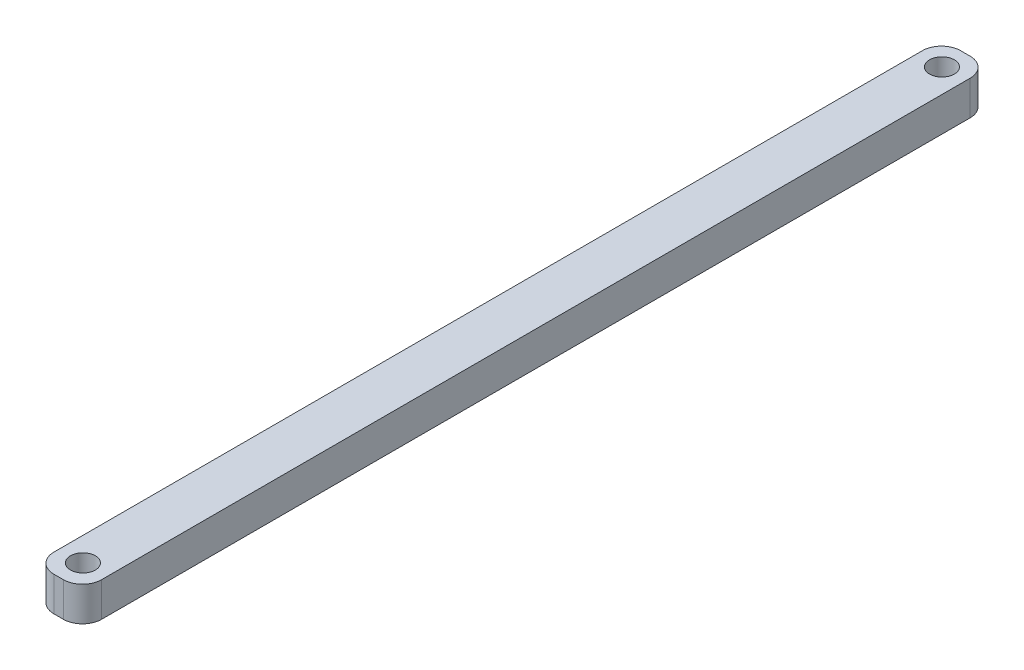
ISO-10303-21;
HEADER;
FILE_DESCRIPTION(('STEP AP214'),'2;1');
FILE_NAME('part.step','',(''),(''),'','','');
FILE_SCHEMA(('AUTOMOTIVE_DESIGN { 1 0 10303 214 1 1 1 1 }'));
ENDSEC;
DATA;
#1=APPLICATION_CONTEXT('core data for automotive mechanical design processes');
#2=APPLICATION_PROTOCOL_DEFINITION('international standard','automotive_design',2000,#1);
#3=PRODUCT_CONTEXT('',#1,'mechanical');
#4=PRODUCT('Part','Part','',(#3));
#5=PRODUCT_RELATED_PRODUCT_CATEGORY('part','',(#4));
#6=PRODUCT_DEFINITION_FORMATION('','',#4);
#7=PRODUCT_DEFINITION_CONTEXT('part definition',#1,'design');
#8=PRODUCT_DEFINITION('design','',#6,#7);
#9=PRODUCT_DEFINITION_SHAPE('','',#8);
#10=(LENGTH_UNIT() NAMED_UNIT(*) SI_UNIT(.MILLI.,.METRE.));
#11=(NAMED_UNIT(*) PLANE_ANGLE_UNIT() SI_UNIT($,.RADIAN.));
#12=(NAMED_UNIT(*) SI_UNIT($,.STERADIAN.) SOLID_ANGLE_UNIT());
#13=UNCERTAINTY_MEASURE_WITH_UNIT(LENGTH_MEASURE(1.E-05),#10,'distance_accuracy_value','');
#14=(GEOMETRIC_REPRESENTATION_CONTEXT(3) GLOBAL_UNCERTAINTY_ASSIGNED_CONTEXT((#13)) GLOBAL_UNIT_ASSIGNED_CONTEXT((#10,
#11,#12)) REPRESENTATION_CONTEXT('',''));
#15=CARTESIAN_POINT('',(0.,0.,0.));
#16=DIRECTION('',(0.,0.,1.));
#17=DIRECTION('',(1.,0.,0.));
#18=AXIS2_PLACEMENT_3D('',#15,#16,#17);
#19=CARTESIAN_POINT('',(-6.35,4.572,-30.5496499416569));
#20=DIRECTION('',(1.,0.,0.));
#21=DIRECTION('',(0.,0.,-1.));
#22=AXIS2_PLACEMENT_3D('',#19,#20,#21);
#23=PLANE('',#22);
#24=DIRECTION('',(0.,0.,1.));
#25=VECTOR('',#24,1.);
#26=CARTESIAN_POINT('',(-6.35,4.572,-30.5496499416569));
#27=LINE('',#26,#25);
#28=CARTESIAN_POINT('',(-6.35,4.572,-28.0096499416569));
#29=VERTEX_POINT('',#28);
#30=CARTESIAN_POINT('',(-6.35,4.572,87.5603500583431));
#31=VERTEX_POINT('',#30);
#32=EDGE_CURVE('E132',#29,#31,#27,.T.);
#33=ORIENTED_EDGE('',*,*,#32,.F.);
#34=DIRECTION('',(0.,-1.,0.));
#35=VECTOR('',#34,1.);
#36=CARTESIAN_POINT('',(-6.35,0.,-28.0096499416569));
#37=LINE('',#36,#35);
#38=CARTESIAN_POINT('',(-6.35,0.,-28.0096499416569));
#39=VERTEX_POINT('',#38);
#40=EDGE_CURVE('E116',#29,#39,#37,.T.);
#41=ORIENTED_EDGE('',*,*,#40,.T.);
#42=DIRECTION('',(0.,0.,1.));
#43=VECTOR('',#42,1.);
#44=CARTESIAN_POINT('',(-6.35,0.,-30.5496499416569));
#45=LINE('',#44,#43);
#46=CARTESIAN_POINT('',(-6.35,0.,87.5603500583431));
#47=VERTEX_POINT('',#46);
#48=EDGE_CURVE('E129',#39,#47,#45,.T.);
#49=ORIENTED_EDGE('',*,*,#48,.T.);
#50=DIRECTION('',(0.,-1.,0.));
#51=VECTOR('',#50,1.);
#52=CARTESIAN_POINT('',(-6.35,4.572,87.5603500583431));
#53=LINE('',#52,#51);
#54=EDGE_CURVE('E135',#47,#31,#53,.F.);
#55=ORIENTED_EDGE('',*,*,#54,.T.);
#56=EDGE_LOOP('',(#33,#41,#49,#55));
#57=FACE_BOUND('',#56,.T.);
#58=ADVANCED_FACE('F45',(#57),#23,.F.);
#59=CARTESIAN_POINT('',(0.,4.572,90.1003500583431));
#60=DIRECTION('',(0.,0.,1.));
#61=DIRECTION('',(1.,0.,0.));
#62=AXIS2_PLACEMENT_3D('',#59,#60,#61);
#63=PLANE('',#62);
#64=DIRECTION('',(-1.,0.,0.));
#65=VECTOR('',#64,1.);
#66=CARTESIAN_POINT('',(0.,0.,90.1003500583431));
#67=LINE('',#66,#65);
#68=CARTESIAN_POINT('',(-2.54,0.,90.1003500583431));
#69=VERTEX_POINT('',#68);
#70=CARTESIAN_POINT('',(-3.81,0.,90.1003500583431));
#71=VERTEX_POINT('',#70);
#72=EDGE_CURVE('E140',#69,#71,#67,.T.);
#73=ORIENTED_EDGE('',*,*,#72,.F.);
#74=DIRECTION('',(0.,-1.,0.));
#75=VECTOR('',#74,1.);
#76=CARTESIAN_POINT('',(-2.54,4.572,90.1003500583431));
#77=LINE('',#76,#75);
#78=CARTESIAN_POINT('',(-2.54,4.572,90.1003500583431));
#79=VERTEX_POINT('',#78);
#80=EDGE_CURVE('E11',#69,#79,#77,.F.);
#81=ORIENTED_EDGE('',*,*,#80,.T.);
#82=DIRECTION('',(-1.,0.,0.));
#83=VECTOR('',#82,1.);
#84=CARTESIAN_POINT('',(0.,4.572,90.1003500583431));
#85=LINE('',#84,#83);
#86=CARTESIAN_POINT('',(-3.81,4.572,90.1003500583431));
#87=VERTEX_POINT('',#86);
#88=EDGE_CURVE('E198',#79,#87,#85,.T.);
#89=ORIENTED_EDGE('',*,*,#88,.T.);
#90=DIRECTION('',(0.,-1.,0.));
#91=VECTOR('',#90,1.);
#92=CARTESIAN_POINT('',(-3.81,0.,90.1003500583431));
#93=LINE('',#92,#91);
#94=EDGE_CURVE('E54',#87,#71,#93,.T.);
#95=ORIENTED_EDGE('',*,*,#94,.T.);
#96=EDGE_LOOP('',(#73,#81,#89,#95));
#97=FACE_BOUND('',#96,.T.);
#98=ADVANCED_FACE('F196',(#97),#63,.T.);
#99=CARTESIAN_POINT('',(0.,4.572,-30.5496499416569));
#100=DIRECTION('',(1.,0.,0.));
#101=DIRECTION('',(0.,0.,-1.));
#102=AXIS2_PLACEMENT_3D('',#99,#100,#101);
#103=PLANE('',#102);
#104=DIRECTION('',(0.,0.,1.));
#105=VECTOR('',#104,1.);
#106=CARTESIAN_POINT('',(0.,0.,-30.5496499416569));
#107=LINE('',#106,#105);
#108=CARTESIAN_POINT('',(0.,0.,-28.0096499416569));
#109=VERTEX_POINT('',#108);
#110=CARTESIAN_POINT('',(0.,0.,87.560350058343));
#111=VERTEX_POINT('',#110);
#112=EDGE_CURVE('E145',#109,#111,#107,.T.);
#113=ORIENTED_EDGE('',*,*,#112,.F.);
#114=DIRECTION('',(0.,-1.,0.));
#115=VECTOR('',#114,1.);
#116=CARTESIAN_POINT('',(0.,4.572,-28.0096499416569));
#117=LINE('',#116,#115);
#118=CARTESIAN_POINT('',(0.,4.572,-28.0096499416569));
#119=VERTEX_POINT('',#118);
#120=EDGE_CURVE('E68',#109,#119,#117,.F.);
#121=ORIENTED_EDGE('',*,*,#120,.T.);
#122=DIRECTION('',(0.,0.,1.));
#123=VECTOR('',#122,1.);
#124=CARTESIAN_POINT('',(0.,4.572,-30.5496499416569));
#125=LINE('',#124,#123);
#126=CARTESIAN_POINT('',(0.,4.572,87.560350058343));
#127=VERTEX_POINT('',#126);
#128=EDGE_CURVE('E205',#119,#127,#125,.T.);
#129=ORIENTED_EDGE('',*,*,#128,.T.);
#130=DIRECTION('',(0.,-1.,0.));
#131=VECTOR('',#130,1.);
#132=CARTESIAN_POINT('',(0.,4.572,87.5603500583431));
#133=LINE('',#132,#131);
#134=EDGE_CURVE('E185',#127,#111,#133,.T.);
#135=ORIENTED_EDGE('',*,*,#134,.T.);
#136=EDGE_LOOP('',(#113,#121,#129,#135));
#137=FACE_BOUND('',#136,.T.);
#138=ADVANCED_FACE('F204',(#137),#103,.T.);
#139=CARTESIAN_POINT('',(-6.35,4.572,-30.5496499416569));
#140=DIRECTION('',(0.,0.,-1.));
#141=DIRECTION('',(-1.,0.,0.));
#142=AXIS2_PLACEMENT_3D('',#139,#140,#141);
#143=PLANE('',#142);
#144=DIRECTION('',(1.,0.,0.));
#145=VECTOR('',#144,1.);
#146=CARTESIAN_POINT('',(-6.35,0.,-30.5496499416569));
#147=LINE('',#146,#145);
#148=CARTESIAN_POINT('',(-3.81,0.,-30.5496499416569));
#149=VERTEX_POINT('',#148);
#150=CARTESIAN_POINT('',(-2.54,0.,-30.5496499416569));
#151=VERTEX_POINT('',#150);
#152=EDGE_CURVE('E157',#149,#151,#147,.T.);
#153=ORIENTED_EDGE('',*,*,#152,.F.);
#154=DIRECTION('',(0.,-1.,0.));
#155=VECTOR('',#154,1.);
#156=CARTESIAN_POINT('',(-3.81,4.572,-30.5496499416569));
#157=LINE('',#156,#155);
#158=CARTESIAN_POINT('',(-3.81,4.572,-30.5496499416569));
#159=VERTEX_POINT('',#158);
#160=EDGE_CURVE('E117',#149,#159,#157,.F.);
#161=ORIENTED_EDGE('',*,*,#160,.T.);
#162=DIRECTION('',(1.,0.,0.));
#163=VECTOR('',#162,1.);
#164=CARTESIAN_POINT('',(-6.35,4.572,-30.5496499416569));
#165=LINE('',#164,#163);
#166=CARTESIAN_POINT('',(-2.54,4.572,-30.5496499416569));
#167=VERTEX_POINT('',#166);
#168=EDGE_CURVE('E151',#159,#167,#165,.T.);
#169=ORIENTED_EDGE('',*,*,#168,.T.);
#170=DIRECTION('',(0.,-1.,0.));
#171=VECTOR('',#170,1.);
#172=CARTESIAN_POINT('',(-2.54,4.572,-30.5496499416569));
#173=LINE('',#172,#171);
#174=EDGE_CURVE('E123',#167,#151,#173,.T.);
#175=ORIENTED_EDGE('',*,*,#174,.T.);
#176=EDGE_LOOP('',(#153,#161,#169,#175));
#177=FACE_BOUND('',#176,.T.);
#178=ADVANCED_FACE('F239',(#177),#143,.T.);
#179=CARTESIAN_POINT('',(0.,4.572,0.));
#180=DIRECTION('',(0.,-1.,0.));
#181=DIRECTION('',(-1.,0.,0.));
#182=AXIS2_PLACEMENT_3D('',#179,#180,#181);
#183=PLANE('',#182);
#184=CARTESIAN_POINT('',(-3.175,4.572,86.868));
#185=DIRECTION('',(0.,1.,0.));
#186=DIRECTION('',(0.,0.,1.));
#187=AXIS2_PLACEMENT_3D('',#184,#185,#186);
#188=CIRCLE('',#187,1.65099999999999);
#189=CARTESIAN_POINT('',(-3.175,4.572,88.519));
#190=VERTEX_POINT('',#189);
#191=EDGE_CURVE('E217',#190,#190,#188,.T.);
#192=ORIENTED_EDGE('',*,*,#191,.F.);
#193=EDGE_LOOP('',(#192));
#194=FACE_BOUND('',#193,.T.);
#195=CARTESIAN_POINT('',(-3.175,4.572,-27.432));
#196=DIRECTION('',(0.,1.,0.));
#197=DIRECTION('',(0.,0.,1.));
#198=AXIS2_PLACEMENT_3D('',#195,#196,#197);
#199=CIRCLE('',#198,1.65099999999999);
#200=CARTESIAN_POINT('',(-3.175,4.572,-25.781));
#201=VERTEX_POINT('',#200);
#202=EDGE_CURVE('E148',#201,#201,#199,.T.);
#203=ORIENTED_EDGE('',*,*,#202,.F.);
#204=EDGE_LOOP('',(#203));
#205=FACE_BOUND('',#204,.T.);
#206=ORIENTED_EDGE('',*,*,#168,.F.);
#207=CARTESIAN_POINT('',(-3.81,4.572,-28.0096499416569));
#208=DIRECTION('',(0.,-1.,0.));
#209=DIRECTION('',(0.,0.,-1.));
#210=AXIS2_PLACEMENT_3D('',#207,#208,#209);
#211=CIRCLE('',#210,2.54);
#212=EDGE_CURVE('E182',#159,#29,#211,.F.);
#213=ORIENTED_EDGE('',*,*,#212,.T.);
#214=ORIENTED_EDGE('',*,*,#32,.T.);
#215=CARTESIAN_POINT('',(-3.81,4.572,87.5603500583431));
#216=DIRECTION('',(0.,-1.,0.));
#217=DIRECTION('',(0.,0.,-1.));
#218=AXIS2_PLACEMENT_3D('',#215,#216,#217);
#219=CIRCLE('',#218,2.54);
#220=EDGE_CURVE('E174',#31,#87,#219,.F.);
#221=ORIENTED_EDGE('',*,*,#220,.T.);
#222=ORIENTED_EDGE('',*,*,#88,.F.);
#223=CARTESIAN_POINT('',(-2.54,4.572,87.5603500583431));
#224=DIRECTION('',(0.,-1.,0.));
#225=DIRECTION('',(0.,0.,-1.));
#226=AXIS2_PLACEMENT_3D('',#223,#224,#225);
#227=CIRCLE('',#226,2.54);
#228=EDGE_CURVE('E61',#79,#127,#227,.F.);
#229=ORIENTED_EDGE('',*,*,#228,.T.);
#230=ORIENTED_EDGE('',*,*,#128,.F.);
#231=CARTESIAN_POINT('',(-2.54,4.572,-28.0096499416569));
#232=DIRECTION('',(0.,-1.,0.));
#233=DIRECTION('',(0.,0.,-1.));
#234=AXIS2_PLACEMENT_3D('',#231,#232,#233);
#235=CIRCLE('',#234,2.54);
#236=EDGE_CURVE('E179',#119,#167,#235,.F.);
#237=ORIENTED_EDGE('',*,*,#236,.T.);
#238=EDGE_LOOP('',(#206,#213,#214,#221,#222,#229,#230,#237));
#239=FACE_BOUND('',#238,.T.);
#240=ADVANCED_FACE('F236',(#194,#205,#239),#183,.F.);
#241=CARTESIAN_POINT('',(0.,0.,0.));
#242=DIRECTION('',(0.,-1.,0.));
#243=DIRECTION('',(-1.,0.,0.));
#244=AXIS2_PLACEMENT_3D('',#241,#242,#243);
#245=PLANE('',#244);
#246=CARTESIAN_POINT('',(-3.175,0.,86.868));
#247=DIRECTION('',(0.,1.,0.));
#248=DIRECTION('',(0.,0.,1.));
#249=AXIS2_PLACEMENT_3D('',#246,#247,#248);
#250=CIRCLE('',#249,1.65099999999999);
#251=CARTESIAN_POINT('',(-3.175,0.,88.519));
#252=VERTEX_POINT('',#251);
#253=EDGE_CURVE('E222',#252,#252,#250,.T.);
#254=ORIENTED_EDGE('',*,*,#253,.T.);
#255=EDGE_LOOP('',(#254));
#256=FACE_BOUND('',#255,.T.);
#257=CARTESIAN_POINT('',(-3.175,0.,-27.432));
#258=DIRECTION('',(0.,1.,0.));
#259=DIRECTION('',(0.,0.,1.));
#260=AXIS2_PLACEMENT_3D('',#257,#258,#259);
#261=CIRCLE('',#260,1.65099999999999);
#262=CARTESIAN_POINT('',(-3.175,0.,-25.781));
#263=VERTEX_POINT('',#262);
#264=EDGE_CURVE('E141',#263,#263,#261,.T.);
#265=ORIENTED_EDGE('',*,*,#264,.T.);
#266=EDGE_LOOP('',(#265));
#267=FACE_BOUND('',#266,.T.);
#268=ORIENTED_EDGE('',*,*,#48,.F.);
#269=CARTESIAN_POINT('',(-3.81,0.,-28.0096499416569));
#270=DIRECTION('',(0.,-1.,0.));
#271=DIRECTION('',(0.,0.,-1.));
#272=AXIS2_PLACEMENT_3D('',#269,#270,#271);
#273=CIRCLE('',#272,2.54);
#274=EDGE_CURVE('E112',#39,#149,#273,.T.);
#275=ORIENTED_EDGE('',*,*,#274,.T.);
#276=ORIENTED_EDGE('',*,*,#152,.T.);
#277=CARTESIAN_POINT('',(-2.54,0.,-28.0096499416569));
#278=DIRECTION('',(0.,-1.,0.));
#279=DIRECTION('',(0.,0.,-1.));
#280=AXIS2_PLACEMENT_3D('',#277,#278,#279);
#281=CIRCLE('',#280,2.54);
#282=EDGE_CURVE('E124',#151,#109,#281,.T.);
#283=ORIENTED_EDGE('',*,*,#282,.T.);
#284=ORIENTED_EDGE('',*,*,#112,.T.);
#285=CARTESIAN_POINT('',(-2.54,0.,87.5603500583431));
#286=DIRECTION('',(0.,-1.,0.));
#287=DIRECTION('',(0.,0.,-1.));
#288=AXIS2_PLACEMENT_3D('',#285,#286,#287);
#289=CIRCLE('',#288,2.54);
#290=EDGE_CURVE('E164',#111,#69,#289,.T.);
#291=ORIENTED_EDGE('',*,*,#290,.T.);
#292=ORIENTED_EDGE('',*,*,#72,.T.);
#293=CARTESIAN_POINT('',(-3.81,0.,87.5603500583431));
#294=DIRECTION('',(0.,-1.,0.));
#295=DIRECTION('',(0.,0.,-1.));
#296=AXIS2_PLACEMENT_3D('',#293,#294,#295);
#297=CIRCLE('',#296,2.54);
#298=EDGE_CURVE('E134',#71,#47,#297,.T.);
#299=ORIENTED_EDGE('',*,*,#298,.T.);
#300=EDGE_LOOP('',(#268,#275,#276,#283,#284,#291,#292,#299));
#301=FACE_BOUND('',#300,.T.);
#302=ADVANCED_FACE('F137',(#256,#267,#301),#245,.T.);
#303=CARTESIAN_POINT('',(-3.175,0.,-27.432));
#304=DIRECTION('',(0.,1.,0.));
#305=DIRECTION('',(0.,0.,1.));
#306=AXIS2_PLACEMENT_3D('',#303,#304,#305);
#307=CYLINDRICAL_SURFACE('',#306,1.65099999999999);
#308=ORIENTED_EDGE('',*,*,#264,.F.);
#309=EDGE_LOOP('',(#308));
#310=FACE_BOUND('',#309,.T.);
#311=ORIENTED_EDGE('',*,*,#202,.T.);
#312=EDGE_LOOP('',(#311));
#313=FACE_BOUND('',#312,.T.);
#314=ADVANCED_FACE('F232',(#310,#313),#307,.F.);
#315=CARTESIAN_POINT('',(-3.175,0.,86.868));
#316=DIRECTION('',(0.,1.,0.));
#317=DIRECTION('',(0.,0.,1.));
#318=AXIS2_PLACEMENT_3D('',#315,#316,#317);
#319=CYLINDRICAL_SURFACE('',#318,1.65099999999999);
#320=ORIENTED_EDGE('',*,*,#253,.F.);
#321=EDGE_LOOP('',(#320));
#322=FACE_BOUND('',#321,.T.);
#323=ORIENTED_EDGE('',*,*,#191,.T.);
#324=EDGE_LOOP('',(#323));
#325=FACE_BOUND('',#324,.T.);
#326=ADVANCED_FACE('F229',(#322,#325),#319,.F.);
#327=CARTESIAN_POINT('',(-3.81,4.572,-28.0096499416569));
#328=DIRECTION('',(0.,1.,0.));
#329=DIRECTION('',(0.,0.,1.));
#330=AXIS2_PLACEMENT_3D('',#327,#328,#329);
#331=CYLINDRICAL_SURFACE('',#330,2.54);
#332=ORIENTED_EDGE('',*,*,#212,.F.);
#333=ORIENTED_EDGE('',*,*,#160,.F.);
#334=ORIENTED_EDGE('',*,*,#274,.F.);
#335=ORIENTED_EDGE('',*,*,#40,.F.);
#336=EDGE_LOOP('',(#332,#333,#334,#335));
#337=FACE_BOUND('',#336,.T.);
#338=ADVANCED_FACE('F115',(#337),#331,.T.);
#339=CARTESIAN_POINT('',(-2.54,4.572,-28.0096499416569));
#340=DIRECTION('',(0.,-1.,0.));
#341=DIRECTION('',(0.,0.,-1.));
#342=AXIS2_PLACEMENT_3D('',#339,#340,#341);
#343=CYLINDRICAL_SURFACE('',#342,2.54);
#344=ORIENTED_EDGE('',*,*,#236,.F.);
#345=ORIENTED_EDGE('',*,*,#120,.F.);
#346=ORIENTED_EDGE('',*,*,#282,.F.);
#347=ORIENTED_EDGE('',*,*,#174,.F.);
#348=EDGE_LOOP('',(#344,#345,#346,#347));
#349=FACE_BOUND('',#348,.T.);
#350=ADVANCED_FACE('F246',(#349),#343,.T.);
#351=CARTESIAN_POINT('',(-2.54,4.572,87.5603500583431));
#352=DIRECTION('',(0.,-1.,0.));
#353=DIRECTION('',(0.,0.,-1.));
#354=AXIS2_PLACEMENT_3D('',#351,#352,#353);
#355=CYLINDRICAL_SURFACE('',#354,2.54);
#356=ORIENTED_EDGE('',*,*,#228,.F.);
#357=ORIENTED_EDGE('',*,*,#80,.F.);
#358=ORIENTED_EDGE('',*,*,#290,.F.);
#359=ORIENTED_EDGE('',*,*,#134,.F.);
#360=EDGE_LOOP('',(#356,#357,#358,#359));
#361=FACE_BOUND('',#360,.T.);
#362=ADVANCED_FACE('F203',(#361),#355,.T.);
#363=CARTESIAN_POINT('',(-3.81,4.572,87.5603500583431));
#364=DIRECTION('',(0.,1.,0.));
#365=DIRECTION('',(0.,0.,1.));
#366=AXIS2_PLACEMENT_3D('',#363,#364,#365);
#367=CYLINDRICAL_SURFACE('',#366,2.54);
#368=ORIENTED_EDGE('',*,*,#220,.F.);
#369=ORIENTED_EDGE('',*,*,#54,.F.);
#370=ORIENTED_EDGE('',*,*,#298,.F.);
#371=ORIENTED_EDGE('',*,*,#94,.F.);
#372=EDGE_LOOP('',(#368,#369,#370,#371));
#373=FACE_BOUND('',#372,.T.);
#374=ADVANCED_FACE('F47',(#373),#367,.T.);
#375=CLOSED_SHELL('',(#58,#98,#138,#178,#240,#302,#314,#326,#338,#350,#362,#374));
#376=MANIFOLD_SOLID_BREP('B2',#375);
#377=ADVANCED_BREP_SHAPE_REPRESENTATION('',(#18,#376),#14);
#378=SHAPE_DEFINITION_REPRESENTATION(#9,#377);
ENDSEC;
END-ISO-10303-21;
